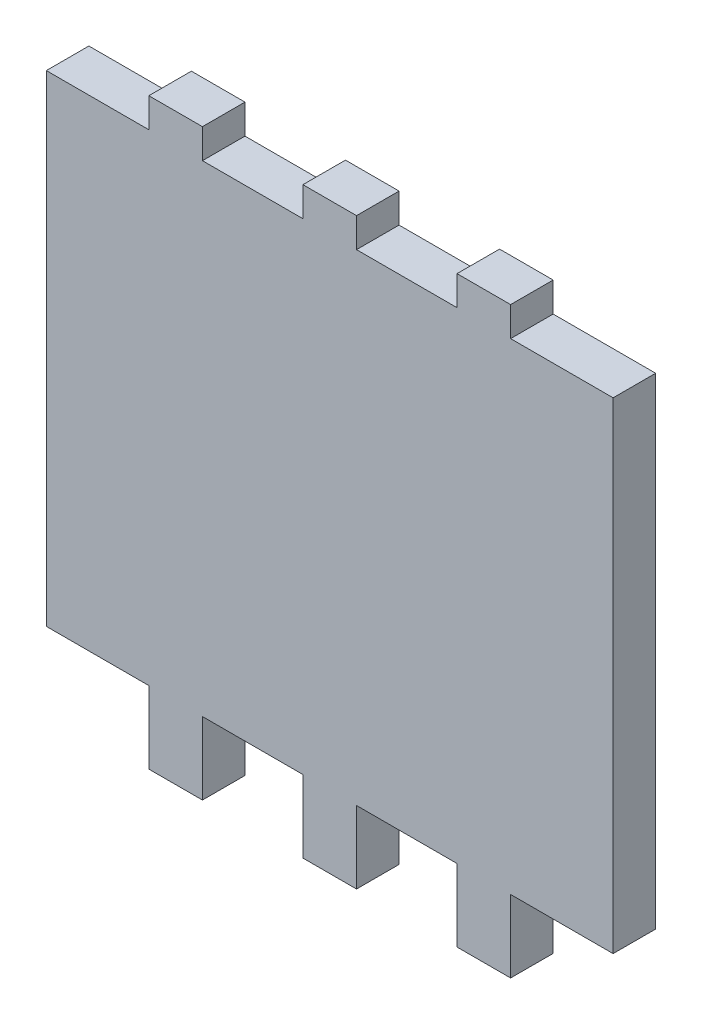
ISO-10303-21;
HEADER;
FILE_DESCRIPTION(('STEP AP214'),'2;1');
FILE_NAME('part.step','',(''),(''),'','','');
FILE_SCHEMA(('AUTOMOTIVE_DESIGN { 1 0 10303 214 1 1 1 1 }'));
ENDSEC;
DATA;
#1=APPLICATION_CONTEXT('core data for automotive mechanical design processes');
#2=APPLICATION_PROTOCOL_DEFINITION('international standard','automotive_design',2000,#1);
#3=PRODUCT_CONTEXT('',#1,'mechanical');
#4=PRODUCT('Part','Part','',(#3));
#5=PRODUCT_RELATED_PRODUCT_CATEGORY('part','',(#4));
#6=PRODUCT_DEFINITION_FORMATION('','',#4);
#7=PRODUCT_DEFINITION_CONTEXT('part definition',#1,'design');
#8=PRODUCT_DEFINITION('design','',#6,#7);
#9=PRODUCT_DEFINITION_SHAPE('','',#8);
#10=(LENGTH_UNIT() NAMED_UNIT(*) SI_UNIT(.MILLI.,.METRE.));
#11=(NAMED_UNIT(*) PLANE_ANGLE_UNIT() SI_UNIT($,.RADIAN.));
#12=(NAMED_UNIT(*) SI_UNIT($,.STERADIAN.) SOLID_ANGLE_UNIT());
#13=UNCERTAINTY_MEASURE_WITH_UNIT(LENGTH_MEASURE(1.E-05),#10,'distance_accuracy_value','');
#14=(GEOMETRIC_REPRESENTATION_CONTEXT(3) GLOBAL_UNCERTAINTY_ASSIGNED_CONTEXT((#13)) GLOBAL_UNIT_ASSIGNED_CONTEXT((#10,
#11,#12)) REPRESENTATION_CONTEXT('',''));
#15=CARTESIAN_POINT('',(0.,0.,0.));
#16=DIRECTION('',(0.,0.,1.));
#17=DIRECTION('',(1.,0.,0.));
#18=AXIS2_PLACEMENT_3D('',#15,#16,#17);
#19=CARTESIAN_POINT('',(-13.5,0.,3.175));
#20=DIRECTION('',(-1.,0.,0.));
#21=DIRECTION('',(0.,-1.,0.));
#22=AXIS2_PLACEMENT_3D('',#19,#20,#21);
#23=PLANE('',#22);
#24=DIRECTION('',(0.,1.,0.));
#25=VECTOR('',#24,1.);
#26=CARTESIAN_POINT('',(-13.5,0.,0.));
#27=LINE('',#26,#25);
#28=CARTESIAN_POINT('',(-13.5,0.,0.));
#29=VERTEX_POINT('',#28);
#30=CARTESIAN_POINT('',(-13.5,5.39999999999999,0.));
#31=VERTEX_POINT('',#30);
#32=EDGE_CURVE('E255',#29,#31,#27,.T.);
#33=ORIENTED_EDGE('',*,*,#32,.F.);
#34=DIRECTION('',(0.,0.,-1.));
#35=VECTOR('',#34,1.);
#36=CARTESIAN_POINT('',(-13.5,0.,3.175));
#37=LINE('',#36,#35);
#38=CARTESIAN_POINT('',(-13.5,0.,3.175));
#39=VERTEX_POINT('',#38);
#40=EDGE_CURVE('E11',#39,#29,#37,.T.);
#41=ORIENTED_EDGE('',*,*,#40,.F.);
#42=DIRECTION('',(0.,1.,0.));
#43=VECTOR('',#42,1.);
#44=CARTESIAN_POINT('',(-13.5,0.,3.175));
#45=LINE('',#44,#43);
#46=CARTESIAN_POINT('',(-13.5,5.39999999999999,3.175));
#47=VERTEX_POINT('',#46);
#48=EDGE_CURVE('E474',#39,#47,#45,.T.);
#49=ORIENTED_EDGE('',*,*,#48,.T.);
#50=DIRECTION('',(0.,0.,-1.));
#51=VECTOR('',#50,1.);
#52=CARTESIAN_POINT('',(-13.5,5.39999999999999,3.175));
#53=LINE('',#52,#51);
#54=EDGE_CURVE('E150',#47,#31,#53,.T.);
#55=ORIENTED_EDGE('',*,*,#54,.T.);
#56=EDGE_LOOP('',(#33,#41,#49,#55));
#57=FACE_BOUND('',#56,.T.);
#58=ADVANCED_FACE('F39',(#57),#23,.T.);
#59=CARTESIAN_POINT('',(0.,0.,3.175));
#60=DIRECTION('',(0.,1.,0.));
#61=DIRECTION('',(-1.,0.,0.));
#62=AXIS2_PLACEMENT_3D('',#59,#60,#61);
#63=PLANE('',#62);
#64=DIRECTION('',(1.,0.,0.));
#65=VECTOR('',#64,1.);
#66=CARTESIAN_POINT('',(0.,0.,0.));
#67=LINE('',#66,#65);
#68=CARTESIAN_POINT('',(-9.49999999999999,0.,0.));
#69=VERTEX_POINT('',#68);
#70=EDGE_CURVE('E258',#29,#69,#67,.T.);
#71=ORIENTED_EDGE('',*,*,#70,.T.);
#72=DIRECTION('',(0.,0.,-1.));
#73=VECTOR('',#72,1.);
#74=CARTESIAN_POINT('',(-9.49999999999999,0.,3.175));
#75=LINE('',#74,#73);
#76=CARTESIAN_POINT('',(-9.49999999999999,0.,3.175));
#77=VERTEX_POINT('',#76);
#78=EDGE_CURVE('E47',#77,#69,#75,.T.);
#79=ORIENTED_EDGE('',*,*,#78,.F.);
#80=DIRECTION('',(1.,0.,0.));
#81=VECTOR('',#80,1.);
#82=CARTESIAN_POINT('',(0.,0.,3.175));
#83=LINE('',#82,#81);
#84=EDGE_CURVE('E394',#39,#77,#83,.T.);
#85=ORIENTED_EDGE('',*,*,#84,.F.);
#86=ORIENTED_EDGE('',*,*,#40,.T.);
#87=EDGE_LOOP('',(#71,#79,#85,#86));
#88=FACE_BOUND('',#87,.T.);
#89=ADVANCED_FACE('F468',(#88),#63,.F.);
#90=CARTESIAN_POINT('',(-9.49999999999999,0.,3.175));
#91=DIRECTION('',(-1.,0.,0.));
#92=DIRECTION('',(0.,-1.,0.));
#93=AXIS2_PLACEMENT_3D('',#90,#91,#92);
#94=PLANE('',#93);
#95=DIRECTION('',(0.,1.,0.));
#96=VECTOR('',#95,1.);
#97=CARTESIAN_POINT('',(-9.49999999999999,0.,0.));
#98=LINE('',#97,#96);
#99=CARTESIAN_POINT('',(-9.50000000000001,5.39999999999999,0.));
#100=VERTEX_POINT('',#99);
#101=EDGE_CURVE('E260',#69,#100,#98,.T.);
#102=ORIENTED_EDGE('',*,*,#101,.T.);
#103=DIRECTION('',(0.,0.,-1.));
#104=VECTOR('',#103,1.);
#105=CARTESIAN_POINT('',(-9.50000000000001,5.39999999999999,3.175));
#106=LINE('',#105,#104);
#107=CARTESIAN_POINT('',(-9.50000000000001,5.39999999999999,3.175));
#108=VERTEX_POINT('',#107);
#109=EDGE_CURVE('E367',#108,#100,#106,.T.);
#110=ORIENTED_EDGE('',*,*,#109,.F.);
#111=DIRECTION('',(0.,1.,0.));
#112=VECTOR('',#111,1.);
#113=CARTESIAN_POINT('',(-9.49999999999999,0.,3.175));
#114=LINE('',#113,#112);
#115=EDGE_CURVE('E376',#77,#108,#114,.T.);
#116=ORIENTED_EDGE('',*,*,#115,.F.);
#117=ORIENTED_EDGE('',*,*,#78,.T.);
#118=EDGE_LOOP('',(#102,#110,#116,#117));
#119=FACE_BOUND('',#118,.T.);
#120=ADVANCED_FACE('F374',(#119),#94,.F.);
#121=CARTESIAN_POINT('',(0.,5.39999999999998,3.175));
#122=DIRECTION('',(0.,1.,0.));
#123=DIRECTION('',(0.,0.,1.));
#124=AXIS2_PLACEMENT_3D('',#121,#122,#123);
#125=PLANE('',#124);
#126=DIRECTION('',(1.,0.,0.));
#127=VECTOR('',#126,1.);
#128=CARTESIAN_POINT('',(0.,5.39999999999998,0.));
#129=LINE('',#128,#127);
#130=CARTESIAN_POINT('',(-2.00000000000001,5.39999999999998,0.));
#131=VERTEX_POINT('',#130);
#132=EDGE_CURVE('E262',#100,#131,#129,.T.);
#133=ORIENTED_EDGE('',*,*,#132,.T.);
#134=DIRECTION('',(0.,0.,-1.));
#135=VECTOR('',#134,1.);
#136=CARTESIAN_POINT('',(-2.00000000000001,5.39999999999998,3.175));
#137=LINE('',#136,#135);
#138=CARTESIAN_POINT('',(-2.00000000000001,5.39999999999998,3.175));
#139=VERTEX_POINT('',#138);
#140=EDGE_CURVE('E365',#139,#131,#137,.T.);
#141=ORIENTED_EDGE('',*,*,#140,.F.);
#142=DIRECTION('',(1.,0.,0.));
#143=VECTOR('',#142,1.);
#144=CARTESIAN_POINT('',(0.,5.39999999999998,3.175));
#145=LINE('',#144,#143);
#146=EDGE_CURVE('E252',#108,#139,#145,.T.);
#147=ORIENTED_EDGE('',*,*,#146,.F.);
#148=ORIENTED_EDGE('',*,*,#109,.T.);
#149=EDGE_LOOP('',(#133,#141,#147,#148));
#150=FACE_BOUND('',#149,.T.);
#151=ADVANCED_FACE('F386',(#150),#125,.F.);
#152=CARTESIAN_POINT('',(-1.99999999999999,0.,3.175));
#153=DIRECTION('',(-1.,0.,0.));
#154=DIRECTION('',(0.,-1.,0.));
#155=AXIS2_PLACEMENT_3D('',#152,#153,#154);
#156=PLANE('',#155);
#157=DIRECTION('',(0.,1.,0.));
#158=VECTOR('',#157,1.);
#159=CARTESIAN_POINT('',(-1.99999999999999,0.,0.));
#160=LINE('',#159,#158);
#161=CARTESIAN_POINT('',(-1.99999999999999,0.,0.));
#162=VERTEX_POINT('',#161);
#163=EDGE_CURVE('E265',#162,#131,#160,.T.);
#164=ORIENTED_EDGE('',*,*,#163,.F.);
#165=DIRECTION('',(0.,0.,-1.));
#166=VECTOR('',#165,1.);
#167=CARTESIAN_POINT('',(-1.99999999999999,0.,3.175));
#168=LINE('',#167,#166);
#169=CARTESIAN_POINT('',(-1.99999999999999,0.,3.175));
#170=VERTEX_POINT('',#169);
#171=EDGE_CURVE('E363',#170,#162,#168,.T.);
#172=ORIENTED_EDGE('',*,*,#171,.F.);
#173=DIRECTION('',(0.,1.,0.));
#174=VECTOR('',#173,1.);
#175=CARTESIAN_POINT('',(-1.99999999999999,0.,3.175));
#176=LINE('',#175,#174);
#177=EDGE_CURVE('E390',#170,#139,#176,.T.);
#178=ORIENTED_EDGE('',*,*,#177,.T.);
#179=ORIENTED_EDGE('',*,*,#140,.T.);
#180=EDGE_LOOP('',(#164,#172,#178,#179));
#181=FACE_BOUND('',#180,.T.);
#182=ADVANCED_FACE('F524',(#181),#156,.T.);
#183=CARTESIAN_POINT('',(0.,0.,3.175));
#184=DIRECTION('',(0.,1.,0.));
#185=DIRECTION('',(-1.,0.,0.));
#186=AXIS2_PLACEMENT_3D('',#183,#184,#185);
#187=PLANE('',#186);
#188=DIRECTION('',(1.,0.,0.));
#189=VECTOR('',#188,1.);
#190=CARTESIAN_POINT('',(0.,0.,0.));
#191=LINE('',#190,#189);
#192=CARTESIAN_POINT('',(2.,0.,0.));
#193=VERTEX_POINT('',#192);
#194=EDGE_CURVE('E270',#162,#193,#191,.T.);
#195=ORIENTED_EDGE('',*,*,#194,.T.);
#196=DIRECTION('',(0.,0.,-1.));
#197=VECTOR('',#196,1.);
#198=CARTESIAN_POINT('',(2.,0.,3.175));
#199=LINE('',#198,#197);
#200=CARTESIAN_POINT('',(2.,0.,3.175));
#201=VERTEX_POINT('',#200);
#202=EDGE_CURVE('E361',#201,#193,#199,.T.);
#203=ORIENTED_EDGE('',*,*,#202,.F.);
#204=DIRECTION('',(1.,0.,0.));
#205=VECTOR('',#204,1.);
#206=CARTESIAN_POINT('',(0.,0.,3.175));
#207=LINE('',#206,#205);
#208=EDGE_CURVE('E392',#170,#201,#207,.T.);
#209=ORIENTED_EDGE('',*,*,#208,.F.);
#210=ORIENTED_EDGE('',*,*,#171,.T.);
#211=EDGE_LOOP('',(#195,#203,#209,#210));
#212=FACE_BOUND('',#211,.T.);
#213=ADVANCED_FACE('F520',(#212),#187,.F.);
#214=CARTESIAN_POINT('',(2.00000000000001,0.,3.175));
#215=DIRECTION('',(1.,0.,0.));
#216=DIRECTION('',(0.,1.,0.));
#217=AXIS2_PLACEMENT_3D('',#214,#215,#216);
#218=PLANE('',#217);
#219=DIRECTION('',(0.,-1.,0.));
#220=VECTOR('',#219,1.);
#221=CARTESIAN_POINT('',(2.00000000000001,0.,0.));
#222=LINE('',#221,#220);
#223=CARTESIAN_POINT('',(1.99999999999999,5.39999999999998,0.));
#224=VERTEX_POINT('',#223);
#225=EDGE_CURVE('E273',#224,#193,#222,.T.);
#226=ORIENTED_EDGE('',*,*,#225,.F.);
#227=DIRECTION('',(0.,0.,-1.));
#228=VECTOR('',#227,1.);
#229=CARTESIAN_POINT('',(1.99999999999999,5.39999999999998,3.175));
#230=LINE('',#229,#228);
#231=CARTESIAN_POINT('',(1.99999999999999,5.39999999999998,3.175));
#232=VERTEX_POINT('',#231);
#233=EDGE_CURVE('E359',#232,#224,#230,.T.);
#234=ORIENTED_EDGE('',*,*,#233,.F.);
#235=DIRECTION('',(0.,-1.,0.));
#236=VECTOR('',#235,1.);
#237=CARTESIAN_POINT('',(2.00000000000001,0.,3.175));
#238=LINE('',#237,#236);
#239=EDGE_CURVE('E397',#232,#201,#238,.T.);
#240=ORIENTED_EDGE('',*,*,#239,.T.);
#241=ORIENTED_EDGE('',*,*,#202,.T.);
#242=EDGE_LOOP('',(#226,#234,#240,#241));
#243=FACE_BOUND('',#242,.T.);
#244=ADVANCED_FACE('F514',(#243),#218,.T.);
#245=CARTESIAN_POINT('',(9.49999999999999,5.39999999999998,0.));
#246=VERTEX_POINT('',#245);
#247=EDGE_CURVE('E267',#224,#246,#129,.T.);
#248=ORIENTED_EDGE('',*,*,#247,.T.);
#249=DIRECTION('',(0.,0.,-1.));
#250=VECTOR('',#249,1.);
#251=CARTESIAN_POINT('',(9.49999999999999,5.39999999999998,3.175));
#252=LINE('',#251,#250);
#253=CARTESIAN_POINT('',(9.49999999999999,5.39999999999998,3.175));
#254=VERTEX_POINT('',#253);
#255=EDGE_CURVE('E357',#254,#246,#252,.T.);
#256=ORIENTED_EDGE('',*,*,#255,.F.);
#257=EDGE_CURVE('E391',#232,#254,#145,.T.);
#258=ORIENTED_EDGE('',*,*,#257,.F.);
#259=ORIENTED_EDGE('',*,*,#233,.T.);
#260=EDGE_LOOP('',(#248,#256,#258,#259));
#261=FACE_BOUND('',#260,.T.);
#262=ADVANCED_FACE('F482',(#261),#125,.F.);
#263=CARTESIAN_POINT('',(9.50000000000002,0.,3.175));
#264=DIRECTION('',(-1.,0.,0.));
#265=DIRECTION('',(0.,-1.,0.));
#266=AXIS2_PLACEMENT_3D('',#263,#264,#265);
#267=PLANE('',#266);
#268=DIRECTION('',(0.,1.,0.));
#269=VECTOR('',#268,1.);
#270=CARTESIAN_POINT('',(9.50000000000002,0.,0.));
#271=LINE('',#270,#269);
#272=CARTESIAN_POINT('',(9.50000000000001,0.,0.));
#273=VERTEX_POINT('',#272);
#274=EDGE_CURVE('E276',#273,#246,#271,.T.);
#275=ORIENTED_EDGE('',*,*,#274,.F.);
#276=DIRECTION('',(0.,0.,-1.));
#277=VECTOR('',#276,1.);
#278=CARTESIAN_POINT('',(9.50000000000001,0.,3.175));
#279=LINE('',#278,#277);
#280=CARTESIAN_POINT('',(9.50000000000001,0.,3.175));
#281=VERTEX_POINT('',#280);
#282=EDGE_CURVE('E355',#281,#273,#279,.T.);
#283=ORIENTED_EDGE('',*,*,#282,.F.);
#284=DIRECTION('',(0.,1.,0.));
#285=VECTOR('',#284,1.);
#286=CARTESIAN_POINT('',(9.50000000000002,0.,3.175));
#287=LINE('',#286,#285);
#288=EDGE_CURVE('E396',#281,#254,#287,.T.);
#289=ORIENTED_EDGE('',*,*,#288,.T.);
#290=ORIENTED_EDGE('',*,*,#255,.T.);
#291=EDGE_LOOP('',(#275,#283,#289,#290));
#292=FACE_BOUND('',#291,.T.);
#293=ADVANCED_FACE('F487',(#292),#267,.T.);
#294=CARTESIAN_POINT('',(0.,0.,3.175));
#295=DIRECTION('',(0.,1.,0.));
#296=DIRECTION('',(-1.,0.,0.));
#297=AXIS2_PLACEMENT_3D('',#294,#295,#296);
#298=PLANE('',#297);
#299=DIRECTION('',(1.,0.,0.));
#300=VECTOR('',#299,1.);
#301=CARTESIAN_POINT('',(0.,0.,0.));
#302=LINE('',#301,#300);
#303=CARTESIAN_POINT('',(13.5,0.,0.));
#304=VERTEX_POINT('',#303);
#305=EDGE_CURVE('E279',#273,#304,#302,.T.);
#306=ORIENTED_EDGE('',*,*,#305,.T.);
#307=DIRECTION('',(0.,0.,-1.));
#308=VECTOR('',#307,1.);
#309=CARTESIAN_POINT('',(13.5,0.,3.175));
#310=LINE('',#309,#308);
#311=CARTESIAN_POINT('',(13.5,0.,3.175));
#312=VERTEX_POINT('',#311);
#313=EDGE_CURVE('E353',#312,#304,#310,.T.);
#314=ORIENTED_EDGE('',*,*,#313,.F.);
#315=DIRECTION('',(1.,0.,0.));
#316=VECTOR('',#315,1.);
#317=CARTESIAN_POINT('',(0.,0.,3.175));
#318=LINE('',#317,#316);
#319=EDGE_CURVE('E403',#281,#312,#318,.T.);
#320=ORIENTED_EDGE('',*,*,#319,.F.);
#321=ORIENTED_EDGE('',*,*,#282,.T.);
#322=EDGE_LOOP('',(#306,#314,#320,#321));
#323=FACE_BOUND('',#322,.T.);
#324=ADVANCED_FACE('F491',(#323),#298,.F.);
#325=CARTESIAN_POINT('',(13.5,0.,3.175));
#326=DIRECTION('',(1.,0.,0.));
#327=DIRECTION('',(0.,1.,0.));
#328=AXIS2_PLACEMENT_3D('',#325,#326,#327);
#329=PLANE('',#328);
#330=DIRECTION('',(0.,-1.,0.));
#331=VECTOR('',#330,1.);
#332=CARTESIAN_POINT('',(13.5,0.,0.));
#333=LINE('',#332,#331);
#334=CARTESIAN_POINT('',(13.5,5.39999999999998,0.));
#335=VERTEX_POINT('',#334);
#336=EDGE_CURVE('E282',#335,#304,#333,.T.);
#337=ORIENTED_EDGE('',*,*,#336,.F.);
#338=DIRECTION('',(0.,0.,-1.));
#339=VECTOR('',#338,1.);
#340=CARTESIAN_POINT('',(13.5,5.39999999999998,3.175));
#341=LINE('',#340,#339);
#342=CARTESIAN_POINT('',(13.5,5.39999999999998,3.175));
#343=VERTEX_POINT('',#342);
#344=EDGE_CURVE('E351',#343,#335,#341,.T.);
#345=ORIENTED_EDGE('',*,*,#344,.F.);
#346=DIRECTION('',(0.,-1.,0.));
#347=VECTOR('',#346,1.);
#348=CARTESIAN_POINT('',(13.5,0.,3.175));
#349=LINE('',#348,#347);
#350=EDGE_CURVE('E408',#343,#312,#349,.T.);
#351=ORIENTED_EDGE('',*,*,#350,.T.);
#352=ORIENTED_EDGE('',*,*,#313,.T.);
#353=EDGE_LOOP('',(#337,#345,#351,#352));
#354=FACE_BOUND('',#353,.T.);
#355=ADVANCED_FACE('F493',(#354),#329,.T.);
#356=CARTESIAN_POINT('',(21.15,5.39999999999998,0.));
#357=VERTEX_POINT('',#356);
#358=EDGE_CURVE('E285',#335,#357,#129,.T.);
#359=ORIENTED_EDGE('',*,*,#358,.T.);
#360=DIRECTION('',(0.,0.,-1.));
#361=VECTOR('',#360,1.);
#362=CARTESIAN_POINT('',(21.15,5.39999999999998,3.175));
#363=LINE('',#362,#361);
#364=CARTESIAN_POINT('',(21.15,5.39999999999998,3.175));
#365=VERTEX_POINT('',#364);
#366=EDGE_CURVE('E349',#365,#357,#363,.T.);
#367=ORIENTED_EDGE('',*,*,#366,.F.);
#368=EDGE_CURVE('E251',#343,#365,#145,.T.);
#369=ORIENTED_EDGE('',*,*,#368,.F.);
#370=ORIENTED_EDGE('',*,*,#344,.T.);
#371=EDGE_LOOP('',(#359,#367,#369,#370));
#372=FACE_BOUND('',#371,.T.);
#373=ADVANCED_FACE('F499',(#372),#125,.F.);
#374=CARTESIAN_POINT('',(21.15,0.,3.175));
#375=DIRECTION('',(1.,0.,0.));
#376=DIRECTION('',(0.,1.,0.));
#377=AXIS2_PLACEMENT_3D('',#374,#375,#376);
#378=PLANE('',#377);
#379=DIRECTION('',(0.,-1.,0.));
#380=VECTOR('',#379,1.);
#381=CARTESIAN_POINT('',(21.15,0.,0.));
#382=LINE('',#381,#380);
#383=CARTESIAN_POINT('',(21.15,41.325,0.));
#384=VERTEX_POINT('',#383);
#385=EDGE_CURVE('E286',#384,#357,#382,.T.);
#386=ORIENTED_EDGE('',*,*,#385,.F.);
#387=DIRECTION('',(0.,0.,-1.));
#388=VECTOR('',#387,1.);
#389=CARTESIAN_POINT('',(21.15,41.325,3.175));
#390=LINE('',#389,#388);
#391=CARTESIAN_POINT('',(21.15,41.325,3.175));
#392=VERTEX_POINT('',#391);
#393=EDGE_CURVE('E347',#392,#384,#390,.T.);
#394=ORIENTED_EDGE('',*,*,#393,.F.);
#395=DIRECTION('',(0.,-1.,0.));
#396=VECTOR('',#395,1.);
#397=CARTESIAN_POINT('',(21.15,0.,3.175));
#398=LINE('',#397,#396);
#399=EDGE_CURVE('E407',#392,#365,#398,.T.);
#400=ORIENTED_EDGE('',*,*,#399,.T.);
#401=ORIENTED_EDGE('',*,*,#366,.T.);
#402=EDGE_LOOP('',(#386,#394,#400,#401));
#403=FACE_BOUND('',#402,.T.);
#404=ADVANCED_FACE('F497',(#403),#378,.T.);
#405=CARTESIAN_POINT('',(0.,41.325,3.175));
#406=DIRECTION('',(0.,-1.,0.));
#407=DIRECTION('',(0.,0.,-1.));
#408=AXIS2_PLACEMENT_3D('',#405,#406,#407);
#409=PLANE('',#408);
#410=DIRECTION('',(-1.,0.,0.));
#411=VECTOR('',#410,1.);
#412=CARTESIAN_POINT('',(0.,41.325,0.));
#413=LINE('',#412,#411);
#414=CARTESIAN_POINT('',(13.5,41.325,0.));
#415=VERTEX_POINT('',#414);
#416=EDGE_CURVE('E289',#384,#415,#413,.T.);
#417=ORIENTED_EDGE('',*,*,#416,.T.);
#418=DIRECTION('',(0.,0.,-1.));
#419=VECTOR('',#418,1.);
#420=CARTESIAN_POINT('',(13.5,41.325,3.175));
#421=LINE('',#420,#419);
#422=CARTESIAN_POINT('',(13.5,41.325,3.175));
#423=VERTEX_POINT('',#422);
#424=EDGE_CURVE('E345',#423,#415,#421,.T.);
#425=ORIENTED_EDGE('',*,*,#424,.F.);
#426=DIRECTION('',(-1.,0.,0.));
#427=VECTOR('',#426,1.);
#428=CARTESIAN_POINT('',(0.,41.325,3.175));
#429=LINE('',#428,#427);
#430=EDGE_CURVE('E414',#392,#423,#429,.T.);
#431=ORIENTED_EDGE('',*,*,#430,.F.);
#432=ORIENTED_EDGE('',*,*,#393,.T.);
#433=EDGE_LOOP('',(#417,#425,#431,#432));
#434=FACE_BOUND('',#433,.T.);
#435=ADVANCED_FACE('F507',(#434),#409,.F.);
#436=CARTESIAN_POINT('',(13.5,0.,3.175));
#437=DIRECTION('',(1.,0.,0.));
#438=DIRECTION('',(0.,0.,-1.));
#439=AXIS2_PLACEMENT_3D('',#436,#437,#438);
#440=PLANE('',#439);
#441=DIRECTION('',(0.,-1.,0.));
#442=VECTOR('',#441,1.);
#443=CARTESIAN_POINT('',(13.5,0.,0.));
#444=LINE('',#443,#442);
#445=CARTESIAN_POINT('',(13.5,43.525,0.));
#446=VERTEX_POINT('',#445);
#447=EDGE_CURVE('E292',#446,#415,#444,.T.);
#448=ORIENTED_EDGE('',*,*,#447,.F.);
#449=DIRECTION('',(0.,0.,-1.));
#450=VECTOR('',#449,1.);
#451=CARTESIAN_POINT('',(13.5,43.525,3.175));
#452=LINE('',#451,#450);
#453=CARTESIAN_POINT('',(13.5,43.525,3.175));
#454=VERTEX_POINT('',#453);
#455=EDGE_CURVE('E343',#454,#446,#452,.T.);
#456=ORIENTED_EDGE('',*,*,#455,.F.);
#457=DIRECTION('',(0.,-1.,0.));
#458=VECTOR('',#457,1.);
#459=CARTESIAN_POINT('',(13.5,0.,3.175));
#460=LINE('',#459,#458);
#461=EDGE_CURVE('E422',#454,#423,#460,.T.);
#462=ORIENTED_EDGE('',*,*,#461,.T.);
#463=ORIENTED_EDGE('',*,*,#424,.T.);
#464=EDGE_LOOP('',(#448,#456,#462,#463));
#465=FACE_BOUND('',#464,.T.);
#466=ADVANCED_FACE('F540',(#465),#440,.T.);
#467=CARTESIAN_POINT('',(0.,43.525,3.175));
#468=DIRECTION('',(0.,1.,0.));
#469=DIRECTION('',(-1.,0.,0.));
#470=AXIS2_PLACEMENT_3D('',#467,#468,#469);
#471=PLANE('',#470);
#472=DIRECTION('',(1.,0.,0.));
#473=VECTOR('',#472,1.);
#474=CARTESIAN_POINT('',(0.,43.525,0.));
#475=LINE('',#474,#473);
#476=CARTESIAN_POINT('',(9.5,43.525,0.));
#477=VERTEX_POINT('',#476);
#478=EDGE_CURVE('E297',#477,#446,#475,.T.);
#479=ORIENTED_EDGE('',*,*,#478,.F.);
#480=DIRECTION('',(0.,0.,-1.));
#481=VECTOR('',#480,1.);
#482=CARTESIAN_POINT('',(9.5,43.525,3.175));
#483=LINE('',#482,#481);
#484=CARTESIAN_POINT('',(9.5,43.525,3.175));
#485=VERTEX_POINT('',#484);
#486=EDGE_CURVE('E341',#485,#477,#483,.T.);
#487=ORIENTED_EDGE('',*,*,#486,.F.);
#488=DIRECTION('',(1.,0.,0.));
#489=VECTOR('',#488,1.);
#490=CARTESIAN_POINT('',(0.,43.525,3.175));
#491=LINE('',#490,#489);
#492=EDGE_CURVE('E427',#485,#454,#491,.T.);
#493=ORIENTED_EDGE('',*,*,#492,.T.);
#494=ORIENTED_EDGE('',*,*,#455,.T.);
#495=EDGE_LOOP('',(#479,#487,#493,#494));
#496=FACE_BOUND('',#495,.T.);
#497=ADVANCED_FACE('F543',(#496),#471,.T.);
#498=CARTESIAN_POINT('',(9.4999999999999,0.,3.175));
#499=DIRECTION('',(1.,0.,0.));
#500=DIRECTION('',(0.,1.,0.));
#501=AXIS2_PLACEMENT_3D('',#498,#499,#500);
#502=PLANE('',#501);
#503=DIRECTION('',(0.,-1.,0.));
#504=VECTOR('',#503,1.);
#505=CARTESIAN_POINT('',(9.4999999999999,0.,0.));
#506=LINE('',#505,#504);
#507=CARTESIAN_POINT('',(9.5,41.325,0.));
#508=VERTEX_POINT('',#507);
#509=EDGE_CURVE('E300',#477,#508,#506,.T.);
#510=ORIENTED_EDGE('',*,*,#509,.T.);
#511=DIRECTION('',(0.,0.,-1.));
#512=VECTOR('',#511,1.);
#513=CARTESIAN_POINT('',(9.5,41.325,3.175));
#514=LINE('',#513,#512);
#515=CARTESIAN_POINT('',(9.5,41.325,3.175));
#516=VERTEX_POINT('',#515);
#517=EDGE_CURVE('E338',#516,#508,#514,.T.);
#518=ORIENTED_EDGE('',*,*,#517,.F.);
#519=DIRECTION('',(0.,-1.,0.));
#520=VECTOR('',#519,1.);
#521=CARTESIAN_POINT('',(9.4999999999999,0.,3.175));
#522=LINE('',#521,#520);
#523=EDGE_CURVE('E430',#485,#516,#522,.T.);
#524=ORIENTED_EDGE('',*,*,#523,.F.);
#525=ORIENTED_EDGE('',*,*,#486,.T.);
#526=EDGE_LOOP('',(#510,#518,#524,#525));
#527=FACE_BOUND('',#526,.T.);
#528=ADVANCED_FACE('F547',(#527),#502,.F.);
#529=CARTESIAN_POINT('',(2.,41.325,0.));
#530=VERTEX_POINT('',#529);
#531=EDGE_CURVE('E294',#508,#530,#413,.T.);
#532=ORIENTED_EDGE('',*,*,#531,.T.);
#533=DIRECTION('',(0.,0.,-1.));
#534=VECTOR('',#533,1.);
#535=CARTESIAN_POINT('',(2.,41.325,3.175));
#536=LINE('',#535,#534);
#537=CARTESIAN_POINT('',(2.,41.325,3.175));
#538=VERTEX_POINT('',#537);
#539=EDGE_CURVE('E336',#538,#530,#536,.T.);
#540=ORIENTED_EDGE('',*,*,#539,.F.);
#541=EDGE_CURVE('E424',#516,#538,#429,.T.);
#542=ORIENTED_EDGE('',*,*,#541,.F.);
#543=ORIENTED_EDGE('',*,*,#517,.T.);
#544=EDGE_LOOP('',(#532,#540,#542,#543));
#545=FACE_BOUND('',#544,.T.);
#546=ADVANCED_FACE('F551',(#545),#409,.F.);
#547=CARTESIAN_POINT('',(1.99999999999993,0.,3.175));
#548=DIRECTION('',(1.,0.,0.));
#549=DIRECTION('',(0.,1.,0.));
#550=AXIS2_PLACEMENT_3D('',#547,#548,#549);
#551=PLANE('',#550);
#552=DIRECTION('',(0.,-1.,0.));
#553=VECTOR('',#552,1.);
#554=CARTESIAN_POINT('',(1.99999999999993,0.,0.));
#555=LINE('',#554,#553);
#556=CARTESIAN_POINT('',(2.,43.525,0.));
#557=VERTEX_POINT('',#556);
#558=EDGE_CURVE('E302',#557,#530,#555,.T.);
#559=ORIENTED_EDGE('',*,*,#558,.F.);
#560=DIRECTION('',(0.,0.,-1.));
#561=VECTOR('',#560,1.);
#562=CARTESIAN_POINT('',(2.,43.525,3.175));
#563=LINE('',#562,#561);
#564=CARTESIAN_POINT('',(2.,43.525,3.175));
#565=VERTEX_POINT('',#564);
#566=EDGE_CURVE('E334',#565,#557,#563,.T.);
#567=ORIENTED_EDGE('',*,*,#566,.F.);
#568=DIRECTION('',(0.,-1.,0.));
#569=VECTOR('',#568,1.);
#570=CARTESIAN_POINT('',(1.99999999999993,0.,3.175));
#571=LINE('',#570,#569);
#572=EDGE_CURVE('E432',#565,#538,#571,.T.);
#573=ORIENTED_EDGE('',*,*,#572,.T.);
#574=ORIENTED_EDGE('',*,*,#539,.T.);
#575=EDGE_LOOP('',(#559,#567,#573,#574));
#576=FACE_BOUND('',#575,.T.);
#577=ADVANCED_FACE('F553',(#576),#551,.T.);
#578=CARTESIAN_POINT('',(0.,43.525,3.175));
#579=DIRECTION('',(0.,1.,0.));
#580=DIRECTION('',(-1.,0.,0.));
#581=AXIS2_PLACEMENT_3D('',#578,#579,#580);
#582=PLANE('',#581);
#583=DIRECTION('',(1.,0.,0.));
#584=VECTOR('',#583,1.);
#585=CARTESIAN_POINT('',(0.,43.525,0.));
#586=LINE('',#585,#584);
#587=CARTESIAN_POINT('',(-2.,43.525,0.));
#588=VERTEX_POINT('',#587);
#589=EDGE_CURVE('E305',#588,#557,#586,.T.);
#590=ORIENTED_EDGE('',*,*,#589,.F.);
#591=DIRECTION('',(0.,0.,-1.));
#592=VECTOR('',#591,1.);
#593=CARTESIAN_POINT('',(-2.,43.525,3.175));
#594=LINE('',#593,#592);
#595=CARTESIAN_POINT('',(-2.,43.525,3.175));
#596=VERTEX_POINT('',#595);
#597=EDGE_CURVE('E332',#596,#588,#594,.T.);
#598=ORIENTED_EDGE('',*,*,#597,.F.);
#599=DIRECTION('',(1.,0.,0.));
#600=VECTOR('',#599,1.);
#601=CARTESIAN_POINT('',(0.,43.525,3.175));
#602=LINE('',#601,#600);
#603=EDGE_CURVE('E435',#596,#565,#602,.T.);
#604=ORIENTED_EDGE('',*,*,#603,.T.);
#605=ORIENTED_EDGE('',*,*,#566,.T.);
#606=EDGE_LOOP('',(#590,#598,#604,#605));
#607=FACE_BOUND('',#606,.T.);
#608=ADVANCED_FACE('F556',(#607),#582,.T.);
#609=CARTESIAN_POINT('',(-2.00000000000005,0.,3.175));
#610=DIRECTION('',(1.,0.,0.));
#611=DIRECTION('',(0.,1.,0.));
#612=AXIS2_PLACEMENT_3D('',#609,#610,#611);
#613=PLANE('',#612);
#614=DIRECTION('',(0.,-1.,0.));
#615=VECTOR('',#614,1.);
#616=CARTESIAN_POINT('',(-2.00000000000005,0.,0.));
#617=LINE('',#616,#615);
#618=CARTESIAN_POINT('',(-2.,41.325,0.));
#619=VERTEX_POINT('',#618);
#620=EDGE_CURVE('E308',#588,#619,#617,.T.);
#621=ORIENTED_EDGE('',*,*,#620,.T.);
#622=DIRECTION('',(0.,0.,-1.));
#623=VECTOR('',#622,1.);
#624=CARTESIAN_POINT('',(-2.,41.325,3.175));
#625=LINE('',#624,#623);
#626=CARTESIAN_POINT('',(-2.,41.325,3.175));
#627=VERTEX_POINT('',#626);
#628=EDGE_CURVE('E329',#627,#619,#625,.T.);
#629=ORIENTED_EDGE('',*,*,#628,.F.);
#630=DIRECTION('',(0.,-1.,0.));
#631=VECTOR('',#630,1.);
#632=CARTESIAN_POINT('',(-2.00000000000005,0.,3.175));
#633=LINE('',#632,#631);
#634=EDGE_CURVE('E438',#596,#627,#633,.T.);
#635=ORIENTED_EDGE('',*,*,#634,.F.);
#636=ORIENTED_EDGE('',*,*,#597,.T.);
#637=EDGE_LOOP('',(#621,#629,#635,#636));
#638=FACE_BOUND('',#637,.T.);
#639=ADVANCED_FACE('F560',(#638),#613,.F.);
#640=CARTESIAN_POINT('',(-9.5,41.325,0.));
#641=VERTEX_POINT('',#640);
#642=EDGE_CURVE('E293',#619,#641,#413,.T.);
#643=ORIENTED_EDGE('',*,*,#642,.T.);
#644=DIRECTION('',(0.,0.,-1.));
#645=VECTOR('',#644,1.);
#646=CARTESIAN_POINT('',(-9.5,41.325,3.175));
#647=LINE('',#646,#645);
#648=CARTESIAN_POINT('',(-9.5,41.325,3.175));
#649=VERTEX_POINT('',#648);
#650=EDGE_CURVE('E327',#649,#641,#647,.T.);
#651=ORIENTED_EDGE('',*,*,#650,.F.);
#652=EDGE_CURVE('E423',#627,#649,#429,.T.);
#653=ORIENTED_EDGE('',*,*,#652,.F.);
#654=ORIENTED_EDGE('',*,*,#628,.T.);
#655=EDGE_LOOP('',(#643,#651,#653,#654));
#656=FACE_BOUND('',#655,.T.);
#657=ADVANCED_FACE('F564',(#656),#409,.F.);
#658=CARTESIAN_POINT('',(-9.50000000000013,0.,3.175));
#659=DIRECTION('',(1.,0.,0.));
#660=DIRECTION('',(0.,1.,0.));
#661=AXIS2_PLACEMENT_3D('',#658,#659,#660);
#662=PLANE('',#661);
#663=DIRECTION('',(0.,-1.,0.));
#664=VECTOR('',#663,1.);
#665=CARTESIAN_POINT('',(-9.50000000000013,0.,0.));
#666=LINE('',#665,#664);
#667=CARTESIAN_POINT('',(-9.49999999999999,43.525,0.));
#668=VERTEX_POINT('',#667);
#669=EDGE_CURVE('E310',#668,#641,#666,.T.);
#670=ORIENTED_EDGE('',*,*,#669,.F.);
#671=DIRECTION('',(0.,0.,-1.));
#672=VECTOR('',#671,1.);
#673=CARTESIAN_POINT('',(-9.49999999999999,43.525,3.175));
#674=LINE('',#673,#672);
#675=CARTESIAN_POINT('',(-9.49999999999999,43.525,3.175));
#676=VERTEX_POINT('',#675);
#677=EDGE_CURVE('E325',#676,#668,#674,.T.);
#678=ORIENTED_EDGE('',*,*,#677,.F.);
#679=DIRECTION('',(0.,-1.,0.));
#680=VECTOR('',#679,1.);
#681=CARTESIAN_POINT('',(-9.50000000000013,0.,3.175));
#682=LINE('',#681,#680);
#683=EDGE_CURVE('E440',#676,#649,#682,.T.);
#684=ORIENTED_EDGE('',*,*,#683,.T.);
#685=ORIENTED_EDGE('',*,*,#650,.T.);
#686=EDGE_LOOP('',(#670,#678,#684,#685));
#687=FACE_BOUND('',#686,.T.);
#688=ADVANCED_FACE('F453',(#687),#662,.T.);
#689=CARTESIAN_POINT('',(0.,43.525,3.175));
#690=DIRECTION('',(0.,1.,0.));
#691=DIRECTION('',(-1.,0.,0.));
#692=AXIS2_PLACEMENT_3D('',#689,#690,#691);
#693=PLANE('',#692);
#694=DIRECTION('',(1.,0.,0.));
#695=VECTOR('',#694,1.);
#696=CARTESIAN_POINT('',(0.,43.525,0.));
#697=LINE('',#696,#695);
#698=CARTESIAN_POINT('',(-13.5,43.525,0.));
#699=VERTEX_POINT('',#698);
#700=EDGE_CURVE('E313',#699,#668,#697,.T.);
#701=ORIENTED_EDGE('',*,*,#700,.F.);
#702=DIRECTION('',(0.,0.,-1.));
#703=VECTOR('',#702,1.);
#704=CARTESIAN_POINT('',(-13.5,43.525,3.175));
#705=LINE('',#704,#703);
#706=CARTESIAN_POINT('',(-13.5,43.525,3.175));
#707=VERTEX_POINT('',#706);
#708=EDGE_CURVE('E323',#707,#699,#705,.T.);
#709=ORIENTED_EDGE('',*,*,#708,.F.);
#710=DIRECTION('',(1.,0.,0.));
#711=VECTOR('',#710,1.);
#712=CARTESIAN_POINT('',(0.,43.525,3.175));
#713=LINE('',#712,#711);
#714=EDGE_CURVE('E443',#707,#676,#713,.T.);
#715=ORIENTED_EDGE('',*,*,#714,.T.);
#716=ORIENTED_EDGE('',*,*,#677,.T.);
#717=EDGE_LOOP('',(#701,#709,#715,#716));
#718=FACE_BOUND('',#717,.T.);
#719=ADVANCED_FACE('F447',(#718),#693,.T.);
#720=CARTESIAN_POINT('',(-13.5000000000001,0.,3.175));
#721=DIRECTION('',(1.,0.,0.));
#722=DIRECTION('',(0.,1.,0.));
#723=AXIS2_PLACEMENT_3D('',#720,#721,#722);
#724=PLANE('',#723);
#725=DIRECTION('',(0.,-1.,0.));
#726=VECTOR('',#725,1.);
#727=CARTESIAN_POINT('',(-13.5000000000001,0.,0.));
#728=LINE('',#727,#726);
#729=CARTESIAN_POINT('',(-13.5,41.325,0.));
#730=VERTEX_POINT('',#729);
#731=EDGE_CURVE('E316',#699,#730,#728,.T.);
#732=ORIENTED_EDGE('',*,*,#731,.T.);
#733=DIRECTION('',(0.,0.,-1.));
#734=VECTOR('',#733,1.);
#735=CARTESIAN_POINT('',(-13.5,41.325,3.175));
#736=LINE('',#735,#734);
#737=CARTESIAN_POINT('',(-13.5,41.325,3.175));
#738=VERTEX_POINT('',#737);
#739=EDGE_CURVE('E245',#738,#730,#736,.T.);
#740=ORIENTED_EDGE('',*,*,#739,.F.);
#741=DIRECTION('',(0.,-1.,0.));
#742=VECTOR('',#741,1.);
#743=CARTESIAN_POINT('',(-13.5000000000001,0.,3.175));
#744=LINE('',#743,#742);
#745=EDGE_CURVE('E236',#707,#738,#744,.T.);
#746=ORIENTED_EDGE('',*,*,#745,.F.);
#747=ORIENTED_EDGE('',*,*,#708,.T.);
#748=EDGE_LOOP('',(#732,#740,#746,#747));
#749=FACE_BOUND('',#748,.T.);
#750=ADVANCED_FACE('F458',(#749),#724,.F.);
#751=CARTESIAN_POINT('',(0.,41.325,3.175));
#752=DIRECTION('',(0.,-1.,0.));
#753=DIRECTION('',(1.,0.,0.));
#754=AXIS2_PLACEMENT_3D('',#751,#752,#753);
#755=PLANE('',#754);
#756=DIRECTION('',(-1.,0.,0.));
#757=VECTOR('',#756,1.);
#758=CARTESIAN_POINT('',(0.,41.325,0.));
#759=LINE('',#758,#757);
#760=CARTESIAN_POINT('',(-21.15,41.325,0.));
#761=VERTEX_POINT('',#760);
#762=EDGE_CURVE('E244',#730,#761,#759,.T.);
#763=ORIENTED_EDGE('',*,*,#762,.T.);
#764=DIRECTION('',(0.,0.,-1.));
#765=VECTOR('',#764,1.);
#766=CARTESIAN_POINT('',(-21.15,41.325,3.175));
#767=LINE('',#766,#765);
#768=CARTESIAN_POINT('',(-21.15,41.325,3.175));
#769=VERTEX_POINT('',#768);
#770=EDGE_CURVE('E241',#769,#761,#767,.T.);
#771=ORIENTED_EDGE('',*,*,#770,.F.);
#772=DIRECTION('',(-1.,0.,0.));
#773=VECTOR('',#772,1.);
#774=CARTESIAN_POINT('',(0.,41.325,3.175));
#775=LINE('',#774,#773);
#776=EDGE_CURVE('E229',#738,#769,#775,.T.);
#777=ORIENTED_EDGE('',*,*,#776,.F.);
#778=ORIENTED_EDGE('',*,*,#739,.T.);
#779=EDGE_LOOP('',(#763,#771,#777,#778));
#780=FACE_BOUND('',#779,.T.);
#781=ADVANCED_FACE('F242',(#780),#755,.F.);
#782=CARTESIAN_POINT('',(-21.15,0.,3.175));
#783=DIRECTION('',(1.,0.,0.));
#784=DIRECTION('',(0.,1.,0.));
#785=AXIS2_PLACEMENT_3D('',#782,#783,#784);
#786=PLANE('',#785);
#787=DIRECTION('',(0.,-1.,0.));
#788=VECTOR('',#787,1.);
#789=CARTESIAN_POINT('',(-21.15,0.,0.));
#790=LINE('',#789,#788);
#791=CARTESIAN_POINT('',(-21.15,5.39999999999998,0.));
#792=VERTEX_POINT('',#791);
#793=EDGE_CURVE('E143',#761,#792,#790,.T.);
#794=ORIENTED_EDGE('',*,*,#793,.T.);
#795=DIRECTION('',(0.,0.,-1.));
#796=VECTOR('',#795,1.);
#797=CARTESIAN_POINT('',(-21.15,5.39999999999998,3.175));
#798=LINE('',#797,#796);
#799=CARTESIAN_POINT('',(-21.15,5.39999999999998,3.175));
#800=VERTEX_POINT('',#799);
#801=EDGE_CURVE('E246',#800,#792,#798,.T.);
#802=ORIENTED_EDGE('',*,*,#801,.F.);
#803=DIRECTION('',(0.,-1.,0.));
#804=VECTOR('',#803,1.);
#805=CARTESIAN_POINT('',(-21.15,0.,3.175));
#806=LINE('',#805,#804);
#807=EDGE_CURVE('E233',#769,#800,#806,.T.);
#808=ORIENTED_EDGE('',*,*,#807,.F.);
#809=ORIENTED_EDGE('',*,*,#770,.T.);
#810=EDGE_LOOP('',(#794,#802,#808,#809));
#811=FACE_BOUND('',#810,.T.);
#812=ADVANCED_FACE('F248',(#811),#786,.F.);
#813=EDGE_CURVE('E266',#792,#31,#129,.T.);
#814=ORIENTED_EDGE('',*,*,#813,.T.);
#815=ORIENTED_EDGE('',*,*,#54,.F.);
#816=EDGE_CURVE('E55',#800,#47,#145,.T.);
#817=ORIENTED_EDGE('',*,*,#816,.F.);
#818=ORIENTED_EDGE('',*,*,#801,.T.);
#819=EDGE_LOOP('',(#814,#815,#817,#818));
#820=FACE_BOUND('',#819,.T.);
#821=ADVANCED_FACE('F502',(#820),#125,.F.);
#822=CARTESIAN_POINT('',(0.,0.,3.175));
#823=DIRECTION('',(0.,0.,1.));
#824=DIRECTION('',(1.,0.,0.));
#825=AXIS2_PLACEMENT_3D('',#822,#823,#824);
#826=PLANE('',#825);
#827=ORIENTED_EDGE('',*,*,#48,.F.);
#828=ORIENTED_EDGE('',*,*,#84,.T.);
#829=ORIENTED_EDGE('',*,*,#115,.T.);
#830=ORIENTED_EDGE('',*,*,#146,.T.);
#831=ORIENTED_EDGE('',*,*,#177,.F.);
#832=ORIENTED_EDGE('',*,*,#208,.T.);
#833=ORIENTED_EDGE('',*,*,#239,.F.);
#834=ORIENTED_EDGE('',*,*,#257,.T.);
#835=ORIENTED_EDGE('',*,*,#288,.F.);
#836=ORIENTED_EDGE('',*,*,#319,.T.);
#837=ORIENTED_EDGE('',*,*,#350,.F.);
#838=ORIENTED_EDGE('',*,*,#368,.T.);
#839=ORIENTED_EDGE('',*,*,#399,.F.);
#840=ORIENTED_EDGE('',*,*,#430,.T.);
#841=ORIENTED_EDGE('',*,*,#461,.F.);
#842=ORIENTED_EDGE('',*,*,#492,.F.);
#843=ORIENTED_EDGE('',*,*,#523,.T.);
#844=ORIENTED_EDGE('',*,*,#541,.T.);
#845=ORIENTED_EDGE('',*,*,#572,.F.);
#846=ORIENTED_EDGE('',*,*,#603,.F.);
#847=ORIENTED_EDGE('',*,*,#634,.T.);
#848=ORIENTED_EDGE('',*,*,#652,.T.);
#849=ORIENTED_EDGE('',*,*,#683,.F.);
#850=ORIENTED_EDGE('',*,*,#714,.F.);
#851=ORIENTED_EDGE('',*,*,#745,.T.);
#852=ORIENTED_EDGE('',*,*,#776,.T.);
#853=ORIENTED_EDGE('',*,*,#807,.T.);
#854=ORIENTED_EDGE('',*,*,#816,.T.);
#855=EDGE_LOOP('',(#827,#828,#829,#830,#831,#832,#833,#834,#835,#836,#837,#838,#839,#840,#841,
#842,#843,#844,#845,#846,#847,#848,#849,#850,#851,#852,#853,#854));
#856=FACE_BOUND('',#855,.T.);
#857=ADVANCED_FACE('F231',(#856),#826,.T.);
#858=CARTESIAN_POINT('',(0.,0.,0.));
#859=DIRECTION('',(0.,0.,1.));
#860=DIRECTION('',(1.,0.,0.));
#861=AXIS2_PLACEMENT_3D('',#858,#859,#860);
#862=PLANE('',#861);
#863=ORIENTED_EDGE('',*,*,#32,.T.);
#864=ORIENTED_EDGE('',*,*,#813,.F.);
#865=ORIENTED_EDGE('',*,*,#793,.F.);
#866=ORIENTED_EDGE('',*,*,#762,.F.);
#867=ORIENTED_EDGE('',*,*,#731,.F.);
#868=ORIENTED_EDGE('',*,*,#700,.T.);
#869=ORIENTED_EDGE('',*,*,#669,.T.);
#870=ORIENTED_EDGE('',*,*,#642,.F.);
#871=ORIENTED_EDGE('',*,*,#620,.F.);
#872=ORIENTED_EDGE('',*,*,#589,.T.);
#873=ORIENTED_EDGE('',*,*,#558,.T.);
#874=ORIENTED_EDGE('',*,*,#531,.F.);
#875=ORIENTED_EDGE('',*,*,#509,.F.);
#876=ORIENTED_EDGE('',*,*,#478,.T.);
#877=ORIENTED_EDGE('',*,*,#447,.T.);
#878=ORIENTED_EDGE('',*,*,#416,.F.);
#879=ORIENTED_EDGE('',*,*,#385,.T.);
#880=ORIENTED_EDGE('',*,*,#358,.F.);
#881=ORIENTED_EDGE('',*,*,#336,.T.);
#882=ORIENTED_EDGE('',*,*,#305,.F.);
#883=ORIENTED_EDGE('',*,*,#274,.T.);
#884=ORIENTED_EDGE('',*,*,#247,.F.);
#885=ORIENTED_EDGE('',*,*,#225,.T.);
#886=ORIENTED_EDGE('',*,*,#194,.F.);
#887=ORIENTED_EDGE('',*,*,#163,.T.);
#888=ORIENTED_EDGE('',*,*,#132,.F.);
#889=ORIENTED_EDGE('',*,*,#101,.F.);
#890=ORIENTED_EDGE('',*,*,#70,.F.);
#891=EDGE_LOOP('',(#863,#864,#865,#866,#867,#868,#869,#870,#871,#872,#873,#874,#875,#876,#877,
#878,#879,#880,#881,#882,#883,#884,#885,#886,#887,#888,#889,#890));
#892=FACE_BOUND('',#891,.T.);
#893=ADVANCED_FACE('F381',(#892),#862,.F.);
#894=CLOSED_SHELL('',(#58,#89,#120,#151,#182,#213,#244,#262,#293,#324,#355,#373,#404,#435,#466,
#497,#528,#546,#577,#608,#639,#657,#688,#719,#750,#781,#812,#821,#857,#893));
#895=MANIFOLD_SOLID_BREP('B2',#894);
#896=ADVANCED_BREP_SHAPE_REPRESENTATION('',(#18,#895),#14);
#897=SHAPE_DEFINITION_REPRESENTATION(#9,#896);
ENDSEC;
END-ISO-10303-21;
